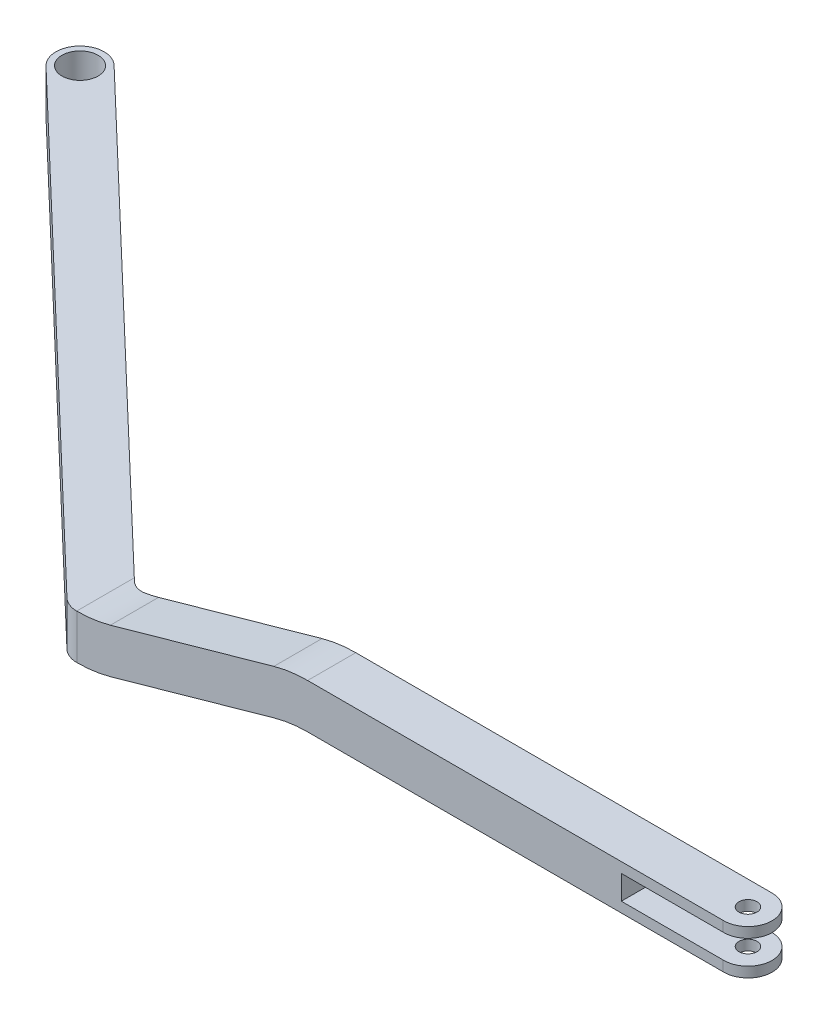
ISO-10303-21;
HEADER;
FILE_DESCRIPTION(('STEP AP214'),'2;1');
FILE_NAME('part.step','',(''),(''),'','','');
FILE_SCHEMA(('AUTOMOTIVE_DESIGN { 1 0 10303 214 1 1 1 1 }'));
ENDSEC;
DATA;
#1=APPLICATION_CONTEXT('core data for automotive mechanical design processes');
#2=APPLICATION_PROTOCOL_DEFINITION('international standard','automotive_design',2000,#1);
#3=PRODUCT_CONTEXT('',#1,'mechanical');
#4=PRODUCT('Part','Part','',(#3));
#5=PRODUCT_RELATED_PRODUCT_CATEGORY('part','',(#4));
#6=PRODUCT_DEFINITION_FORMATION('','',#4);
#7=PRODUCT_DEFINITION_CONTEXT('part definition',#1,'design');
#8=PRODUCT_DEFINITION('design','',#6,#7);
#9=PRODUCT_DEFINITION_SHAPE('','',#8);
#10=(LENGTH_UNIT() NAMED_UNIT(*) SI_UNIT(.MILLI.,.METRE.));
#11=(NAMED_UNIT(*) PLANE_ANGLE_UNIT() SI_UNIT($,.RADIAN.));
#12=(NAMED_UNIT(*) SI_UNIT($,.STERADIAN.) SOLID_ANGLE_UNIT());
#13=UNCERTAINTY_MEASURE_WITH_UNIT(LENGTH_MEASURE(1.E-05),#10,'distance_accuracy_value','');
#14=(GEOMETRIC_REPRESENTATION_CONTEXT(3) GLOBAL_UNCERTAINTY_ASSIGNED_CONTEXT((#13)) GLOBAL_UNIT_ASSIGNED_CONTEXT((#10,
#11,#12)) REPRESENTATION_CONTEXT('',''));
#15=CARTESIAN_POINT('',(0.,0.,0.));
#16=DIRECTION('',(0.,0.,1.));
#17=DIRECTION('',(1.,0.,0.));
#18=AXIS2_PLACEMENT_3D('',#15,#16,#17);
#19=CARTESIAN_POINT('',(36.9937445666572,8.3,-3.29798633083513));
#20=DIRECTION('',(0.,-1.,0.));
#21=DIRECTION('',(0.,0.,-1.));
#22=AXIS2_PLACEMENT_3D('',#19,#20,#21);
#23=CYLINDRICAL_SURFACE('',#22,2.00083185761732);
#24=DIRECTION('',(0.,-1.,0.));
#25=VECTOR('',#24,1.);
#26=CARTESIAN_POINT('',(36.9189693004379,8.3,-1.29855221538691));
#27=LINE('',#26,#25);
#28=CARTESIAN_POINT('',(36.9189693004379,8.3,-1.29855221538691));
#29=VERTEX_POINT('',#28);
#30=CARTESIAN_POINT('',(36.9189693004376,7.45,-1.29855221538692));
#31=VERTEX_POINT('',#30);
#32=EDGE_CURVE('E456',#29,#31,#27,.T.);
#33=ORIENTED_EDGE('',*,*,#32,.T.);
#34=CARTESIAN_POINT('',(36.9937445666572,7.45,-3.29798633083513));
#35=DIRECTION('',(0.,1.,0.));
#36=DIRECTION('',(0.,0.,1.));
#37=AXIS2_PLACEMENT_3D('',#34,#35,#36);
#38=CIRCLE('',#37,2.00083185761732);
#39=CARTESIAN_POINT('',(37.0301830090221,7.45,-5.2984863589217));
#40=VERTEX_POINT('',#39);
#41=EDGE_CURVE('E44',#31,#40,#38,.T.);
#42=ORIENTED_EDGE('',*,*,#41,.T.);
#43=CARTESIAN_POINT('',(36.9937445666572,7.45,-3.29798633083513));
#44=DIRECTION('',(0.,1.,0.));
#45=DIRECTION('',(0.0182116464340387,0.,-0.999834154214669));
#46=AXIS2_PLACEMENT_3D('',#43,#44,#45);
#47=CIRCLE('',#46,2.00083185761732);
#48=CARTESIAN_POINT('',(36.9573061242915,7.45,-5.29848635892169));
#49=VERTEX_POINT('',#48);
#50=EDGE_CURVE('E11',#40,#49,#47,.T.);
#51=ORIENTED_EDGE('',*,*,#50,.T.);
#52=DIRECTION('',(0.,-1.,0.));
#53=VECTOR('',#52,1.);
#54=CARTESIAN_POINT('',(36.9573061242915,8.3,-5.29848635892169));
#55=LINE('',#54,#53);
#56=CARTESIAN_POINT('',(36.9573061242915,8.3,-5.29848635892169));
#57=VERTEX_POINT('',#56);
#58=EDGE_CURVE('E410',#57,#49,#55,.T.);
#59=ORIENTED_EDGE('',*,*,#58,.F.);
#60=CARTESIAN_POINT('',(36.9937445666572,8.3,-3.29798633083513));
#61=DIRECTION('',(0.,1.,0.));
#62=DIRECTION('',(0.,0.,1.));
#63=AXIS2_PLACEMENT_3D('',#60,#61,#62);
#64=CIRCLE('',#63,2.00083185761732);
#65=EDGE_CURVE('E442',#29,#57,#64,.T.);
#66=ORIENTED_EDGE('',*,*,#65,.F.);
#67=EDGE_LOOP('',(#33,#42,#51,#59,#66));
#68=FACE_BOUND('',#67,.T.);
#69=ADVANCED_FACE('F39',(#68),#23,.T.);
#70=CARTESIAN_POINT('',(38.9945764242745,7.45,-42.6756421682449));
#71=DIRECTION('',(0.,1.,0.));
#72=DIRECTION('',(0.,0.,1.));
#73=AXIS2_PLACEMENT_3D('',#70,#71,#72);
#74=PLANE('',#73);
#75=DIRECTION('',(0.,0.,1.));
#76=VECTOR('',#75,1.);
#77=CARTESIAN_POINT('',(28.4745764242745,7.45,-42.6756421682449));
#78=LINE('',#77,#76);
#79=CARTESIAN_POINT('',(28.4745764242745,7.45,-5.29848635892169));
#80=VERTEX_POINT('',#79);
#81=CARTESIAN_POINT('',(28.4745764242745,7.45,-1.29855221538692));
#82=VERTEX_POINT('',#81);
#83=EDGE_CURVE('E406',#80,#82,#78,.T.);
#84=ORIENTED_EDGE('',*,*,#83,.F.);
#85=DIRECTION('',(-1.,0.,0.));
#86=VECTOR('',#85,1.);
#87=CARTESIAN_POINT('',(36.9573061242915,7.45,-5.29848635892169));
#88=LINE('',#87,#86);
#89=EDGE_CURVE('E382',#49,#80,#88,.T.);
#90=ORIENTED_EDGE('',*,*,#89,.F.);
#91=ORIENTED_EDGE('',*,*,#50,.F.);
#92=ORIENTED_EDGE('',*,*,#41,.F.);
#93=DIRECTION('',(-1.,0.,0.));
#94=VECTOR('',#93,1.);
#95=CARTESIAN_POINT('',(38.9945764242745,7.45,-1.29855221538692));
#96=LINE('',#95,#94);
#97=EDGE_CURVE('E549',#31,#82,#96,.T.);
#98=ORIENTED_EDGE('',*,*,#97,.T.);
#99=EDGE_LOOP('',(#84,#90,#91,#92,#98));
#100=FACE_BOUND('',#99,.T.);
#101=CARTESIAN_POINT('',(36.9937445666572,7.45,-3.29798633083513));
#102=DIRECTION('',(0.,1.,0.));
#103=DIRECTION('',(0.,0.,1.));
#104=AXIS2_PLACEMENT_3D('',#101,#102,#103);
#105=CIRCLE('',#104,0.749999999999998);
#106=CARTESIAN_POINT('',(36.9937445666572,7.45,-2.54798633083513));
#107=VERTEX_POINT('',#106);
#108=EDGE_CURVE('E370',#107,#107,#105,.T.);
#109=ORIENTED_EDGE('',*,*,#108,.T.);
#110=EDGE_LOOP('',(#109));
#111=FACE_BOUND('',#110,.T.);
#112=ADVANCED_FACE('F345',(#100,#111),#74,.F.);
#113=CARTESIAN_POINT('',(28.4745764242745,5.45,-42.6756421682449));
#114=DIRECTION('',(0.,-1.,0.));
#115=DIRECTION('',(0.,0.,-1.));
#116=AXIS2_PLACEMENT_3D('',#113,#114,#115);
#117=PLANE('',#116);
#118=DIRECTION('',(1.,0.,0.));
#119=VECTOR('',#118,1.);
#120=CARTESIAN_POINT('',(28.4745764242745,5.45,-1.29855221538692));
#121=LINE('',#120,#119);
#122=CARTESIAN_POINT('',(28.4745764242745,5.45,-1.29855221538692));
#123=VERTEX_POINT('',#122);
#124=CARTESIAN_POINT('',(36.9189693004376,5.45,-1.29855221538692));
#125=VERTEX_POINT('',#124);
#126=EDGE_CURVE('E552',#123,#125,#121,.T.);
#127=ORIENTED_EDGE('',*,*,#126,.T.);
#128=CARTESIAN_POINT('',(36.9937445666572,5.45,-3.29798633083513));
#129=DIRECTION('',(0.,-1.,0.));
#130=DIRECTION('',(0.,0.,-1.));
#131=AXIS2_PLACEMENT_3D('',#128,#129,#130);
#132=CIRCLE('',#131,2.00083185761732);
#133=CARTESIAN_POINT('',(37.0301830090221,5.45,-5.2984863589217));
#134=VERTEX_POINT('',#133);
#135=EDGE_CURVE('E63',#134,#125,#132,.T.);
#136=ORIENTED_EDGE('',*,*,#135,.F.);
#137=CARTESIAN_POINT('',(36.9937445666572,5.45,-3.29798633083513));
#138=DIRECTION('',(0.,-1.,0.));
#139=DIRECTION('',(-0.0182116464344202,0.,-0.999834154214662));
#140=AXIS2_PLACEMENT_3D('',#137,#138,#139);
#141=CIRCLE('',#140,2.00083185761732);
#142=CARTESIAN_POINT('',(36.9573061242915,5.45,-5.29848635892169));
#143=VERTEX_POINT('',#142);
#144=EDGE_CURVE('E50',#143,#134,#141,.T.);
#145=ORIENTED_EDGE('',*,*,#144,.F.);
#146=DIRECTION('',(1.,0.,0.));
#147=VECTOR('',#146,1.);
#148=CARTESIAN_POINT('',(36.9573061242915,5.45,-5.29848635892169));
#149=LINE('',#148,#147);
#150=CARTESIAN_POINT('',(28.4745764242745,5.45,-5.29848635892169));
#151=VERTEX_POINT('',#150);
#152=EDGE_CURVE('E360',#151,#143,#149,.T.);
#153=ORIENTED_EDGE('',*,*,#152,.F.);
#154=DIRECTION('',(0.,0.,1.));
#155=VECTOR('',#154,1.);
#156=CARTESIAN_POINT('',(28.4745764242745,5.45,-42.6756421682449));
#157=LINE('',#156,#155);
#158=EDGE_CURVE('E365',#151,#123,#157,.T.);
#159=ORIENTED_EDGE('',*,*,#158,.T.);
#160=EDGE_LOOP('',(#127,#136,#145,#153,#159));
#161=FACE_BOUND('',#160,.T.);
#162=CARTESIAN_POINT('',(36.9937445666572,5.45,-3.29798633083513));
#163=DIRECTION('',(0.,-1.,0.));
#164=DIRECTION('',(0.,0.,-1.));
#165=AXIS2_PLACEMENT_3D('',#162,#163,#164);
#166=CIRCLE('',#165,0.749999999999998);
#167=CARTESIAN_POINT('',(36.9937445666572,5.45,-4.04798633083512));
#168=VERTEX_POINT('',#167);
#169=EDGE_CURVE('E308',#168,#168,#166,.T.);
#170=ORIENTED_EDGE('',*,*,#169,.T.);
#171=EDGE_LOOP('',(#170));
#172=FACE_BOUND('',#171,.T.);
#173=ADVANCED_FACE('F340',(#161,#172),#117,.F.);
#174=CARTESIAN_POINT('',(36.9937445666572,8.3,-3.29798633083513));
#175=DIRECTION('',(0.,-1.,0.));
#176=DIRECTION('',(0.,0.,-1.));
#177=AXIS2_PLACEMENT_3D('',#174,#175,#176);
#178=CYLINDRICAL_SURFACE('',#177,0.749999999999998);
#179=ORIENTED_EDGE('',*,*,#108,.F.);
#180=EDGE_LOOP('',(#179));
#181=FACE_BOUND('',#180,.T.);
#182=CARTESIAN_POINT('',(36.9937445666572,8.3,-3.29798633083513));
#183=DIRECTION('',(0.,1.,0.));
#184=DIRECTION('',(0.,0.,1.));
#185=AXIS2_PLACEMENT_3D('',#182,#183,#184);
#186=CIRCLE('',#185,0.749999999999999);
#187=CARTESIAN_POINT('',(36.9937445666572,8.3,-2.54798633083513));
#188=VERTEX_POINT('',#187);
#189=EDGE_CURVE('E430',#188,#188,#186,.T.);
#190=ORIENTED_EDGE('',*,*,#189,.T.);
#191=EDGE_LOOP('',(#190));
#192=FACE_BOUND('',#191,.T.);
#193=ADVANCED_FACE('F344',(#181,#192),#178,.F.);
#194=CARTESIAN_POINT('',(36.9937445666572,8.3,-3.29798633083513));
#195=DIRECTION('',(0.,1.,0.));
#196=DIRECTION('',(0.,0.,1.));
#197=AXIS2_PLACEMENT_3D('',#194,#195,#196);
#198=PLANE('',#197);
#199=ORIENTED_EDGE('',*,*,#189,.F.);
#200=EDGE_LOOP('',(#199));
#201=FACE_BOUND('',#200,.T.);
#202=DIRECTION('',(-1.,0.,0.));
#203=VECTOR('',#202,1.);
#204=CARTESIAN_POINT('',(36.9573061242915,8.3,-5.29848635892169));
#205=LINE('',#204,#203);
#206=CARTESIAN_POINT('',(2.41497993869398,8.3,-5.2984863589217));
#207=VERTEX_POINT('',#206);
#208=EDGE_CURVE('E414',#57,#207,#205,.T.);
#209=ORIENTED_EDGE('',*,*,#208,.T.);
#210=DIRECTION('',(0.,0.,1.));
#211=VECTOR('',#210,1.);
#212=CARTESIAN_POINT('',(2.41497993869398,8.3,-42.6756421682449));
#213=LINE('',#212,#211);
#214=CARTESIAN_POINT('',(2.41497993869398,8.3,-1.29855221538692));
#215=VERTEX_POINT('',#214);
#216=EDGE_CURVE('E204',#207,#215,#213,.T.);
#217=ORIENTED_EDGE('',*,*,#216,.T.);
#218=DIRECTION('',(1.,0.,0.));
#219=VECTOR('',#218,1.);
#220=CARTESIAN_POINT('',(-16.707593816575,8.3,-1.29855221538692));
#221=LINE('',#220,#219);
#222=EDGE_CURVE('E446',#215,#29,#221,.T.);
#223=ORIENTED_EDGE('',*,*,#222,.T.);
#224=ORIENTED_EDGE('',*,*,#65,.T.);
#225=EDGE_LOOP('',(#209,#217,#223,#224));
#226=FACE_BOUND('',#225,.T.);
#227=ADVANCED_FACE('F425',(#201,#226),#198,.T.);
#228=CARTESIAN_POINT('',(36.9937445666572,0.,-3.29798633083513));
#229=DIRECTION('',(0.,1.,0.));
#230=DIRECTION('',(0.,0.,1.));
#231=AXIS2_PLACEMENT_3D('',#228,#229,#230);
#232=PLANE('',#231);
#233=CARTESIAN_POINT('',(-55.8665357872914,0.,-40.6756421682449));
#234=DIRECTION('',(0.,1.,0.));
#235=DIRECTION('',(0.,0.,1.));
#236=AXIS2_PLACEMENT_3D('',#233,#234,#235);
#237=CIRCLE('',#236,1.5);
#238=CARTESIAN_POINT('',(-55.8665357872914,0.,-39.1756421682449));
#239=VERTEX_POINT('',#238);
#240=EDGE_CURVE('E432',#239,#239,#237,.T.);
#241=ORIENTED_EDGE('',*,*,#240,.T.);
#242=EDGE_LOOP('',(#241));
#243=FACE_BOUND('',#242,.T.);
#244=DIRECTION('',(-0.723015211725438,0.,-0.690832109570495));
#245=VECTOR('',#244,1.);
#246=CARTESIAN_POINT('',(-16.5260173161096,0.,-5.85245593547083));
#247=LINE('',#246,#245);
#248=CARTESIAN_POINT('',(-16.7482829126781,0.,-6.06482796924297));
#249=VERTEX_POINT('',#248);
#250=CARTESIAN_POINT('',(-54.4848715681504,0.,-42.1216725916958));
#251=VERTEX_POINT('',#250);
#252=EDGE_CURVE('E436',#249,#251,#247,.T.);
#253=ORIENTED_EDGE('',*,*,#252,.F.);
#254=DIRECTION('',(0.,0.,1.));
#255=VECTOR('',#254,1.);
#256=CARTESIAN_POINT('',(-16.7482829126781,0.,-42.6756421682449));
#257=LINE('',#256,#255);
#258=CARTESIAN_POINT('',(-16.7482829126781,0.,-1.29855221538692));
#259=VERTEX_POINT('',#258);
#260=EDGE_CURVE('E226',#249,#259,#257,.T.);
#261=ORIENTED_EDGE('',*,*,#260,.T.);
#262=CARTESIAN_POINT('',(-16.7481986495322,0.,-3.29855392790748));
#263=DIRECTION('',(0.,1.,0.));
#264=DIRECTION('',(0.,0.,1.));
#265=AXIS2_PLACEMENT_3D('',#262,#263,#264);
#266=CIRCLE('',#265,2.00000000000003);
#267=CARTESIAN_POINT('',(-18.1298628686732,0.,-1.85252350445656));
#268=VERTEX_POINT('',#267);
#269=EDGE_CURVE('E444',#268,#259,#266,.T.);
#270=ORIENTED_EDGE('',*,*,#269,.F.);
#271=DIRECTION('',(0.723015211725438,0.,0.690832109570495));
#272=VECTOR('',#271,1.);
#273=CARTESIAN_POINT('',(-57.2482000064324,0.,-39.229611744794));
#274=LINE('',#273,#272);
#275=CARTESIAN_POINT('',(-57.2482000064324,0.,-39.229611744794));
#276=VERTEX_POINT('',#275);
#277=EDGE_CURVE('E452',#276,#268,#274,.T.);
#278=ORIENTED_EDGE('',*,*,#277,.F.);
#279=CARTESIAN_POINT('',(-55.8665357872914,0.,-40.6756421682449));
#280=DIRECTION('',(0.,1.,0.));
#281=DIRECTION('',(0.,0.,-1.));
#282=AXIS2_PLACEMENT_3D('',#279,#280,#281);
#283=CIRCLE('',#282,2.00000000000001);
#284=EDGE_CURVE('E208',#251,#276,#283,.T.);
#285=ORIENTED_EDGE('',*,*,#284,.F.);
#286=EDGE_LOOP('',(#253,#261,#270,#278,#285));
#287=FACE_BOUND('',#286,.T.);
#288=ADVANCED_FACE('F475',(#243,#287),#232,.F.);
#289=CARTESIAN_POINT('',(36.9573061242915,8.3,-5.29848635892169));
#290=DIRECTION('',(0.,0.,1.));
#291=DIRECTION('',(1.,0.,0.));
#292=AXIS2_PLACEMENT_3D('',#289,#290,#291);
#293=PLANE('',#292);
#294=ORIENTED_EDGE('',*,*,#58,.T.);
#295=ORIENTED_EDGE('',*,*,#89,.T.);
#296=DIRECTION('',(0.,-1.,0.));
#297=VECTOR('',#296,1.);
#298=CARTESIAN_POINT('',(28.4745764242745,8.3,-5.29848635892169));
#299=LINE('',#298,#297);
#300=EDGE_CURVE('E327',#80,#151,#299,.T.);
#301=ORIENTED_EDGE('',*,*,#300,.T.);
#302=ORIENTED_EDGE('',*,*,#152,.T.);
#303=CARTESIAN_POINT('',(36.9573061242915,4.60000000000001,-5.29848635892169));
#304=VERTEX_POINT('',#303);
#305=EDGE_CURVE('E221',#143,#304,#55,.T.);
#306=ORIENTED_EDGE('',*,*,#305,.T.);
#307=DIRECTION('',(-1.,0.,0.));
#308=VECTOR('',#307,1.);
#309=CARTESIAN_POINT('',(36.9573061242915,4.60000000000001,-5.29848635892169));
#310=LINE('',#309,#308);
#311=CARTESIAN_POINT('',(2.43783536205152,4.60000000000001,-5.2984863589217));
#312=VERTEX_POINT('',#311);
#313=EDGE_CURVE('E225',#304,#312,#310,.T.);
#314=ORIENTED_EDGE('',*,*,#313,.T.);
#315=CARTESIAN_POINT('',(2.43783536205152,-5.39999999999999,-5.29848635892169));
#316=DIRECTION('',(0.,0.,1.));
#317=DIRECTION('',(1.,0.,0.));
#318=AXIS2_PLACEMENT_3D('',#315,#316,#317);
#319=ELLIPSE('',#318,10.1767339402036,10.);
#320=CARTESIAN_POINT('',(-0.367252672079279,4.21261695938321,-5.29848635892169));
#321=VERTEX_POINT('',#320);
#322=EDGE_CURVE('E289',#312,#321,#319,.T.);
#323=ORIENTED_EDGE('',*,*,#322,.T.);
#324=DIRECTION('',(-0.962521476409949,-0.271205470906492,0.));
#325=VECTOR('',#324,1.);
#326=CARTESIAN_POINT('',(35.2789698930869,14.2564973441426,-5.29848635892169));
#327=LINE('',#326,#325);
#328=CARTESIAN_POINT('',(-13.9431948785473,0.387383040616798,-5.2984863589217));
#329=VERTEX_POINT('',#328);
#330=EDGE_CURVE('E518',#321,#329,#327,.T.);
#331=ORIENTED_EDGE('',*,*,#330,.T.);
#332=CARTESIAN_POINT('',(-16.7482829126781,10.,-5.29848635892169));
#333=DIRECTION('',(0.,0.,1.));
#334=DIRECTION('',(-1.,0.,0.));
#335=AXIS2_PLACEMENT_3D('',#332,#333,#334);
#336=ELLIPSE('',#335,10.1767339402036,10.);
#337=CARTESIAN_POINT('',(-15.1443530969686,0.124981675503623,-5.29848635892171));
#338=VERTEX_POINT('',#337);
#339=EDGE_CURVE('E433',#338,#329,#336,.T.);
#340=ORIENTED_EDGE('',*,*,#339,.F.);
#341=DIRECTION('',(0.,-1.,0.));
#342=VECTOR('',#341,1.);
#343=CARTESIAN_POINT('',(-15.1443530969686,8.3,-5.2984863589217));
#344=LINE('',#343,#342);
#345=CARTESIAN_POINT('',(-15.1443530969686,3.82859230214382,-5.29848635892171));
#346=VERTEX_POINT('',#345);
#347=EDGE_CURVE('E219',#346,#338,#344,.T.);
#348=ORIENTED_EDGE('',*,*,#347,.F.);
#349=CARTESIAN_POINT('',(-16.7711383360356,13.7,-5.29848635892169));
#350=DIRECTION('',(0.,0.,1.));
#351=DIRECTION('',(1.,0.,0.));
#352=AXIS2_PLACEMENT_3D('',#349,#350,#351);
#353=ELLIPSE('',#352,10.1767339402036,10.);
#354=CARTESIAN_POINT('',(-13.9660503019048,4.0873830406168,-5.29848635892169));
#355=VERTEX_POINT('',#354);
#356=EDGE_CURVE('E572',#346,#355,#353,.T.);
#357=ORIENTED_EDGE('',*,*,#356,.T.);
#358=DIRECTION('',(0.962521476409949,0.271205470906491,0.));
#359=VECTOR('',#358,1.);
#360=CARTESIAN_POINT('',(34.3114367876864,17.6903196412108,-5.29848635892169));
#361=LINE('',#360,#359);
#362=CARTESIAN_POINT('',(-0.390108095436824,7.9126169593832,-5.2984863589217));
#363=VERTEX_POINT('',#362);
#364=EDGE_CURVE('E269',#355,#363,#361,.T.);
#365=ORIENTED_EDGE('',*,*,#364,.T.);
#366=CARTESIAN_POINT('',(2.41497993869397,-1.7,-5.29848635892169));
#367=DIRECTION('',(0.,0.,-1.));
#368=DIRECTION('',(-1.,0.,0.));
#369=AXIS2_PLACEMENT_3D('',#366,#367,#368);
#370=ELLIPSE('',#369,10.1767339402036,10.);
#371=EDGE_CURVE('E568',#363,#207,#370,.T.);
#372=ORIENTED_EDGE('',*,*,#371,.T.);
#373=ORIENTED_EDGE('',*,*,#208,.F.);
#374=EDGE_LOOP('',(#294,#295,#301,#302,#306,#314,#323,#331,#340,#348,#357,#365,#372,#373));
#375=FACE_BOUND('',#374,.T.);
#376=ADVANCED_FACE('F411',(#375),#293,.F.);
#377=CARTESIAN_POINT('',(-15.1443530969686,8.3,-7.2984863589217));
#378=DIRECTION('',(0.,-1.,0.));
#379=DIRECTION('',(0.,0.,-1.));
#380=AXIS2_PLACEMENT_3D('',#377,#378,#379);
#381=CYLINDRICAL_SURFACE('',#380,1.99999999999999);
#382=DIRECTION('',(0.,-1.,0.));
#383=VECTOR('',#382,1.);
#384=CARTESIAN_POINT('',(-16.5260173161096,8.3,-5.85245593547083));
#385=LINE('',#384,#383);
#386=CARTESIAN_POINT('',(-16.5260173161096,3.70290119738029,-5.85245593547083));
#387=VERTEX_POINT('',#386);
#388=CARTESIAN_POINT('',(-16.5260173161096,0.00238533540510271,-5.85245593547083));
#389=VERTEX_POINT('',#388);
#390=EDGE_CURVE('E212',#387,#389,#385,.T.);
#391=ORIENTED_EDGE('',*,*,#390,.F.);
#392=CARTESIAN_POINT('',(-16.5260173161096,3.70290119738029,-5.85245593547083));
#393=CARTESIAN_POINT('',(-16.4858217405346,3.70385154125688,-5.81404147290284));
#394=CARTESIAN_POINT('',(-16.4440208871399,3.70507660719029,-5.77731599438412));
#395=CARTESIAN_POINT('',(-16.3575227528893,3.70817261746892,-5.70747935555764));
#396=CARTESIAN_POINT('',(-16.3128254131862,3.7100435749399,-5.67436826871923));
#397=CARTESIAN_POINT('',(-16.220825476771,3.71452897199333,-5.61198165077404));
#398=CARTESIAN_POINT('',(-16.1735214982762,3.71714380902462,-5.58270818232273));
#399=CARTESIAN_POINT('',(-16.0766973392706,3.72319520432481,-5.52822550124349));
#400=CARTESIAN_POINT('',(-16.0271773005915,3.72663171006638,-5.50301602898634));
#401=CARTESIAN_POINT('',(-15.8757427206918,3.73828670623872,-5.43371431806882));
#402=CARTESIAN_POINT('',(-15.7709523291798,3.74785073776684,-5.3959478479173));
#403=CARTESIAN_POINT('',(-15.5571663432736,3.77084387299733,-5.33843224894582));
#404=CARTESIAN_POINT('',(-15.4481798642928,3.78426496732322,-5.31864613382681));
#405=CARTESIAN_POINT('',(-15.3063468948048,3.80407619196059,-5.30479097496266));
#406=CARTESIAN_POINT('',(-15.2739379549737,3.80876062742215,-5.30242411304849));
#407=CARTESIAN_POINT('',(-15.2091328174261,3.81844257222107,-5.29927359297725));
#408=CARTESIAN_POINT('',(-15.1767366575702,3.82343966822127,-5.2984878882954));
#409=CARTESIAN_POINT('',(-15.1443530969686,3.82859230214383,-5.29848635892171));
#410=B_SPLINE_CURVE_WITH_KNOTS('',3,(#392,#393,#394,#395,#396,#397,#398,#399,#400,#401,#402,
#403,#404,#405,#406,#407,#408,#409),.UNSPECIFIED.,.F.,.F.,(4,2,2,2,2,2,2,2,4),(0.,
0.166772091527426,0.33354757238191,0.500412327920719,0.667266419042723,1.00096964178975,
1.33398485969385,1.43245119316598,1.53078999742635),.UNSPECIFIED.);
#411=EDGE_CURVE('E497',#387,#346,#410,.T.);
#412=ORIENTED_EDGE('',*,*,#411,.T.);
#413=ORIENTED_EDGE('',*,*,#347,.T.);
#414=CARTESIAN_POINT('',(-16.5260173161096,0.00238533540510271,-5.85245593547083));
#415=CARTESIAN_POINT('',(-16.4858231527149,0.00324687503576391,-5.81404284685564));
#416=CARTESIAN_POINT('',(-16.4440234799147,0.00437954000276688,-5.77731824630781));
#417=CARTESIAN_POINT('',(-16.3575267281272,0.00728423001760441,-5.70748240679937));
#418=CARTESIAN_POINT('',(-16.3128295864509,0.00905626890259747,-5.67437124606006));
#419=CARTESIAN_POINT('',(-16.2208277732829,0.013337974182148,-5.61198306060994));
#420=CARTESIAN_POINT('',(-16.1735216694978,0.0158480490926583,-5.58270817235212));
#421=CARTESIAN_POINT('',(-16.0766913802723,0.0216849128461143,-5.52822225457412));
#422=CARTESIAN_POINT('',(-16.027167337458,0.0250116492344696,-5.50301096421916));
#423=CARTESIAN_POINT('',(-15.8757166336213,0.0363308873924351,-5.43370338792472));
#424=CARTESIAN_POINT('',(-15.7709106499402,0.0456624499978899,-5.39593289151855));
#425=CARTESIAN_POINT('',(-15.5570838160455,0.0681810909279192,-5.33841378377238));
#426=CARTESIAN_POINT('',(-15.4480721427259,0.0813601458060907,-5.31862801730156));
#427=CARTESIAN_POINT('',(-15.3062334061807,0.100851709516164,-5.30478214566609));
#428=CARTESIAN_POINT('',(-15.2738477382854,0.105459345172356,-5.30241863224336));
#429=CARTESIAN_POINT('',(-15.2090883178915,0.114987073488589,-5.29927252230627));
#430=CARTESIAN_POINT('',(-15.1767146040034,0.119906755012077,-5.29848788840278));
#431=CARTESIAN_POINT('',(-15.1443530969686,0.124981675503628,-5.29848635892171));
#432=B_SPLINE_CURVE_WITH_KNOTS('',3,(#414,#415,#416,#417,#418,#419,#420,#421,#422,#423,#424,
#425,#426,#427,#428,#429,#430,#431),.UNSPECIFIED.,.F.,.F.,(4,2,2,2,2,2,2,2,4),(0.,
0.166761886950087,0.333527383132606,0.50038536128926,0.667232624874279,1.00092447909018,
1.33392537316692,1.43228949474585,1.53052660546878),.UNSPECIFIED.);
#433=EDGE_CURVE('E438',#389,#338,#432,.T.);
#434=ORIENTED_EDGE('',*,*,#433,.F.);
#435=EDGE_LOOP('',(#391,#412,#413,#434));
#436=FACE_BOUND('',#435,.T.);
#437=ADVANCED_FACE('F508',(#436),#381,.F.);
#438=CARTESIAN_POINT('',(-16.5260173161096,8.3,-5.85245593547083));
#439=DIRECTION('',(-0.690832109570495,0.,0.723015211725438));
#440=DIRECTION('',(0.723015211725438,0.,0.690832109570495));
#441=AXIS2_PLACEMENT_3D('',#438,#439,#440);
#442=PLANE('',#441);
#443=DIRECTION('',(0.,-1.,0.));
#444=VECTOR('',#443,1.);
#445=CARTESIAN_POINT('',(-54.4848715681504,8.3,-42.1216725916958));
#446=LINE('',#445,#444);
#447=CARTESIAN_POINT('',(-54.4848715681504,3.7,-42.1216725916958));
#448=VERTEX_POINT('',#447);
#449=EDGE_CURVE('E210',#448,#251,#446,.T.);
#450=ORIENTED_EDGE('',*,*,#449,.F.);
#451=DIRECTION('',(0.723015211725438,0.,0.690832109570495));
#452=VECTOR('',#451,1.);
#453=CARTESIAN_POINT('',(-16.5260173161096,3.7,-5.85245593547083));
#454=LINE('',#453,#452);
#455=CARTESIAN_POINT('',(-16.7711383360356,3.7,-6.0866660441232));
#456=VERTEX_POINT('',#455);
#457=EDGE_CURVE('E190',#448,#456,#454,.T.);
#458=ORIENTED_EDGE('',*,*,#457,.T.);
#459=CARTESIAN_POINT('',(-16.7711383360356,3.7,-6.08666604412319));
#460=CARTESIAN_POINT('',(-16.7302818409111,3.69999998279812,-6.04762816738314));
#461=CARTESIAN_POINT('',(-16.6894268416883,3.70024174064554,-6.00859171995876));
#462=CARTESIAN_POINT('',(-16.6077198350463,3.70120880643897,-5.93052168374131));
#463=CARTESIAN_POINT('',(-16.5668678276271,3.70193411438498,-5.89148809494824));
#464=CARTESIAN_POINT('',(-16.5260173161096,3.70290119738029,-5.85245593547083));
#465=B_SPLINE_CURVE_WITH_KNOTS('',3,(#459,#460,#461,#462,#463,#464),.UNSPECIFIED.,.F.,.F.,(4,2,
4),(0.,0.169520803215356,0.339041606430711),.UNSPECIFIED.);
#466=EDGE_CURVE('E480',#456,#387,#465,.T.);
#467=ORIENTED_EDGE('',*,*,#466,.T.);
#468=ORIENTED_EDGE('',*,*,#390,.T.);
#469=CARTESIAN_POINT('',(-16.7482829126781,0.,-6.06482796924297));
#470=CARTESIAN_POINT('',(-16.7112364161821,-1.162841886894E-08,-6.02943049916016));
#471=CARTESIAN_POINT('',(-16.6741910348868,0.000198760507796998,-5.99403409463774));
#472=CARTESIAN_POINT('',(-16.6001025026973,0.000993872309498199,-5.92324341671369));
#473=CARTESIAN_POINT('',(-16.5630593518032,0.00159021197498352,-5.88784914331207));
#474=CARTESIAN_POINT('',(-16.5260173161096,0.00238533540510358,-5.85245593547083));
#475=B_SPLINE_CURVE_WITH_KNOTS('',3,(#469,#470,#471,#472,#473,#474),.UNSPECIFIED.,.F.,.F.,(4,2,
4),(0.,0.153713197706431,0.307426395412859),.UNSPECIFIED.);
#476=EDGE_CURVE('E513',#249,#389,#475,.T.);
#477=ORIENTED_EDGE('',*,*,#476,.F.);
#478=ORIENTED_EDGE('',*,*,#252,.T.);
#479=EDGE_LOOP('',(#450,#458,#467,#468,#477,#478));
#480=FACE_BOUND('',#479,.T.);
#481=ADVANCED_FACE('F504',(#480),#442,.F.);
#482=CARTESIAN_POINT('',(-16.707593816575,8.3,-1.29855221538692));
#483=DIRECTION('',(0.,0.,-1.));
#484=DIRECTION('',(-1.,0.,0.));
#485=AXIS2_PLACEMENT_3D('',#482,#483,#484);
#486=PLANE('',#485);
#487=DIRECTION('',(0.,-1.,0.));
#488=VECTOR('',#487,1.);
#489=CARTESIAN_POINT('',(28.4745764242745,7.45,-1.29855221538692));
#490=LINE('',#489,#488);
#491=EDGE_CURVE('E194',#82,#123,#490,.T.);
#492=ORIENTED_EDGE('',*,*,#491,.F.);
#493=ORIENTED_EDGE('',*,*,#97,.F.);
#494=ORIENTED_EDGE('',*,*,#32,.F.);
#495=ORIENTED_EDGE('',*,*,#222,.F.);
#496=CARTESIAN_POINT('',(2.41497993869397,-1.7,-1.29855221538692));
#497=DIRECTION('',(0.,0.,-1.));
#498=DIRECTION('',(-1.,0.,0.));
#499=AXIS2_PLACEMENT_3D('',#496,#497,#498);
#500=ELLIPSE('',#499,10.1767339402036,10.);
#501=CARTESIAN_POINT('',(-0.390108095436824,7.9126169593832,-1.29855221538692));
#502=VERTEX_POINT('',#501);
#503=EDGE_CURVE('E482',#502,#215,#500,.T.);
#504=ORIENTED_EDGE('',*,*,#503,.F.);
#505=DIRECTION('',(0.962521476409949,0.271205470906491,0.));
#506=VECTOR('',#505,1.);
#507=CARTESIAN_POINT('',(-13.9660503019048,4.0873830406168,-1.29855221538692));
#508=LINE('',#507,#506);
#509=CARTESIAN_POINT('',(-13.9660503019048,4.0873830406168,-1.29855221538692));
#510=VERTEX_POINT('',#509);
#511=EDGE_CURVE('E486',#510,#502,#508,.T.);
#512=ORIENTED_EDGE('',*,*,#511,.F.);
#513=CARTESIAN_POINT('',(-16.7711383360356,13.7,-1.29855221538692));
#514=DIRECTION('',(0.,0.,1.));
#515=DIRECTION('',(1.,0.,0.));
#516=AXIS2_PLACEMENT_3D('',#513,#514,#515);
#517=ELLIPSE('',#516,10.1767339402036,10.);
#518=CARTESIAN_POINT('',(-16.7482829126781,3.70002521925491,-1.29855392968252));
#519=VERTEX_POINT('',#518);
#520=EDGE_CURVE('E331',#519,#510,#517,.T.);
#521=ORIENTED_EDGE('',*,*,#520,.F.);
#522=DIRECTION('',(0.,-1.,0.));
#523=VECTOR('',#522,1.);
#524=CARTESIAN_POINT('',(-16.7482829126781,8.3,-1.29855392968252));
#525=LINE('',#524,#523);
#526=EDGE_CURVE('E214',#519,#259,#525,.T.);
#527=ORIENTED_EDGE('',*,*,#526,.T.);
#528=CARTESIAN_POINT('',(-16.7482829126781,10.,-1.29855221538692));
#529=DIRECTION('',(0.,0.,1.));
#530=DIRECTION('',(-1.,0.,0.));
#531=AXIS2_PLACEMENT_3D('',#528,#529,#530);
#532=ELLIPSE('',#531,10.1767339402036,10.);
#533=CARTESIAN_POINT('',(-13.9431948785473,0.387383040616798,-1.29855221538692));
#534=VERTEX_POINT('',#533);
#535=EDGE_CURVE('E265',#259,#534,#532,.T.);
#536=ORIENTED_EDGE('',*,*,#535,.T.);
#537=DIRECTION('',(-0.962521476409949,-0.271205470906492,0.));
#538=VECTOR('',#537,1.);
#539=CARTESIAN_POINT('',(-0.367252672079279,4.21261695938321,-1.29855221538692));
#540=LINE('',#539,#538);
#541=CARTESIAN_POINT('',(-0.367252672079279,4.21261695938321,-1.29855221538692));
#542=VERTEX_POINT('',#541);
#543=EDGE_CURVE('E268',#542,#534,#540,.T.);
#544=ORIENTED_EDGE('',*,*,#543,.F.);
#545=CARTESIAN_POINT('',(2.43783536205152,-5.39999999999999,-1.29855221538692));
#546=DIRECTION('',(0.,0.,1.));
#547=DIRECTION('',(1.,0.,0.));
#548=AXIS2_PLACEMENT_3D('',#545,#546,#547);
#549=ELLIPSE('',#548,10.1767339402036,10.);
#550=CARTESIAN_POINT('',(2.43783536205152,4.60000000000001,-1.29855221538692));
#551=VERTEX_POINT('',#550);
#552=EDGE_CURVE('E272',#551,#542,#549,.T.);
#553=ORIENTED_EDGE('',*,*,#552,.F.);
#554=DIRECTION('',(-1.,0.,0.));
#555=VECTOR('',#554,1.);
#556=CARTESIAN_POINT('',(36.9189693004379,4.60000000000001,-1.29855221538692));
#557=LINE('',#556,#555);
#558=CARTESIAN_POINT('',(36.9189693004379,4.60000000000001,-1.29855221538691));
#559=VERTEX_POINT('',#558);
#560=EDGE_CURVE('E275',#559,#551,#557,.T.);
#561=ORIENTED_EDGE('',*,*,#560,.F.);
#562=EDGE_CURVE('E448',#125,#559,#27,.T.);
#563=ORIENTED_EDGE('',*,*,#562,.F.);
#564=ORIENTED_EDGE('',*,*,#126,.F.);
#565=EDGE_LOOP('',(#492,#493,#494,#495,#504,#512,#521,#527,#536,#544,#553,#561,#563,#564));
#566=FACE_BOUND('',#565,.T.);
#567=ADVANCED_FACE('F462',(#566),#486,.F.);
#568=ORIENTED_EDGE('',*,*,#135,.T.);
#569=ORIENTED_EDGE('',*,*,#562,.T.);
#570=CARTESIAN_POINT('',(36.9937445666572,4.60000000000001,-3.29798633083513));
#571=DIRECTION('',(0.,1.,0.));
#572=DIRECTION('',(0.,0.,1.));
#573=AXIS2_PLACEMENT_3D('',#570,#571,#572);
#574=CIRCLE('',#573,2.00083185761732);
#575=CARTESIAN_POINT('',(37.0301830090221,4.60000000000001,-5.2984863589217));
#576=VERTEX_POINT('',#575);
#577=EDGE_CURVE('E292',#559,#576,#574,.T.);
#578=ORIENTED_EDGE('',*,*,#577,.T.);
#579=CARTESIAN_POINT('',(36.9937445666572,4.60000000000001,-3.29798633083513));
#580=DIRECTION('',(0.,1.,0.));
#581=DIRECTION('',(0.0182116464340387,0.,-0.999834154214669));
#582=AXIS2_PLACEMENT_3D('',#579,#580,#581);
#583=CIRCLE('',#582,2.00083185761732);
#584=EDGE_CURVE('E233',#576,#304,#583,.T.);
#585=ORIENTED_EDGE('',*,*,#584,.T.);
#586=ORIENTED_EDGE('',*,*,#305,.F.);
#587=ORIENTED_EDGE('',*,*,#144,.T.);
#588=EDGE_LOOP('',(#568,#569,#578,#585,#586,#587));
#589=FACE_BOUND('',#588,.T.);
#590=ADVANCED_FACE('F41',(#589),#23,.T.);
#591=CARTESIAN_POINT('',(-55.8665357872914,8.3,-40.6756421682449));
#592=DIRECTION('',(0.,-1.,0.));
#593=DIRECTION('',(0.,0.,-1.));
#594=AXIS2_PLACEMENT_3D('',#591,#592,#593);
#595=CYLINDRICAL_SURFACE('',#594,2.00000000000001);
#596=DIRECTION('',(0.,-1.,0.));
#597=VECTOR('',#596,1.);
#598=CARTESIAN_POINT('',(-57.2482000064324,8.3,-39.229611744794));
#599=LINE('',#598,#597);
#600=CARTESIAN_POINT('',(-57.2482000064324,3.7,-39.229611744794));
#601=VERTEX_POINT('',#600);
#602=EDGE_CURVE('E201',#601,#276,#599,.T.);
#603=ORIENTED_EDGE('',*,*,#602,.F.);
#604=CARTESIAN_POINT('',(-55.8665357872914,3.7,-40.6756421682449));
#605=DIRECTION('',(0.,-1.,0.));
#606=DIRECTION('',(0.,0.,-1.));
#607=AXIS2_PLACEMENT_3D('',#604,#605,#606);
#608=CIRCLE('',#607,2.00000000000001);
#609=EDGE_CURVE('E183',#601,#448,#608,.T.);
#610=ORIENTED_EDGE('',*,*,#609,.T.);
#611=ORIENTED_EDGE('',*,*,#449,.T.);
#612=ORIENTED_EDGE('',*,*,#284,.T.);
#613=EDGE_LOOP('',(#603,#610,#611,#612));
#614=FACE_BOUND('',#613,.T.);
#615=ADVANCED_FACE('F206',(#614),#595,.T.);
#616=CARTESIAN_POINT('',(-57.2482000064324,8.3,-39.229611744794));
#617=DIRECTION('',(0.690832109570495,0.,-0.723015211725438));
#618=DIRECTION('',(-0.723015211725438,0.,-0.690832109570495));
#619=AXIS2_PLACEMENT_3D('',#616,#617,#618);
#620=PLANE('',#619);
#621=DIRECTION('',(-0.723015211725438,0.,-0.690832109570495));
#622=VECTOR('',#621,1.);
#623=CARTESIAN_POINT('',(-57.2482000064324,3.7,-39.229611744794));
#624=LINE('',#623,#622);
#625=CARTESIAN_POINT('',(-18.1298628686732,3.7,-1.85252350445656));
#626=VERTEX_POINT('',#625);
#627=EDGE_CURVE('E188',#626,#601,#624,.T.);
#628=ORIENTED_EDGE('',*,*,#627,.T.);
#629=ORIENTED_EDGE('',*,*,#602,.T.);
#630=ORIENTED_EDGE('',*,*,#277,.T.);
#631=DIRECTION('',(0.,-1.,0.));
#632=VECTOR('',#631,1.);
#633=CARTESIAN_POINT('',(-18.1298628686732,8.3,-1.85252350445656));
#634=LINE('',#633,#632);
#635=EDGE_CURVE('E203',#626,#268,#634,.T.);
#636=ORIENTED_EDGE('',*,*,#635,.F.);
#637=EDGE_LOOP('',(#628,#629,#630,#636));
#638=FACE_BOUND('',#637,.T.);
#639=ADVANCED_FACE('F199',(#638),#620,.F.);
#640=CARTESIAN_POINT('',(-16.7481986495322,8.3,-3.29855392790748));
#641=DIRECTION('',(0.,-1.,0.));
#642=DIRECTION('',(0.,0.,-1.));
#643=AXIS2_PLACEMENT_3D('',#640,#641,#642);
#644=CYLINDRICAL_SURFACE('',#643,2.00000000000003);
#645=ORIENTED_EDGE('',*,*,#526,.F.);
#646=CARTESIAN_POINT('',(-16.748282912678,3.70002521925491,-1.29855392968252));
#647=CARTESIAN_POINT('',(-16.7520922705551,3.7000168126995,-1.29855409032792));
#648=CARTESIAN_POINT('',(-16.7559015681068,3.70001050781722,-1.29856513397198));
#649=CARTESIAN_POINT('',(-16.7635200425593,3.70000210139892,-1.2986089872574));
#650=CARTESIAN_POINT('',(-16.7673292194602,3.69999999986289,-1.29864179689877));
#651=CARTESIAN_POINT('',(-16.7711383360356,3.7,-1.29868548953879));
#652=B_SPLINE_CURVE_WITH_KNOTS('',3,(#646,#647,#648,#649,#650,#651),.UNSPECIFIED.,.F.,.F.,(4,2,
4),(0.,0.0114279563333715,0.0228559126667471),.UNSPECIFIED.);
#653=CARTESIAN_POINT('',(-16.7711383360356,3.7,-1.29868548953878));
#654=VERTEX_POINT('',#653);
#655=EDGE_CURVE('E300',#519,#654,#652,.T.);
#656=ORIENTED_EDGE('',*,*,#655,.T.);
#657=CARTESIAN_POINT('',(-16.7481986495322,3.7,-3.29855392790748));
#658=DIRECTION('',(0.,-1.,0.));
#659=DIRECTION('',(0.,0.,-1.));
#660=AXIS2_PLACEMENT_3D('',#657,#658,#659);
#661=CIRCLE('',#660,2.00000000000003);
#662=EDGE_CURVE('E298',#654,#626,#661,.T.);
#663=ORIENTED_EDGE('',*,*,#662,.T.);
#664=ORIENTED_EDGE('',*,*,#635,.T.);
#665=ORIENTED_EDGE('',*,*,#269,.T.);
#666=EDGE_LOOP('',(#645,#656,#663,#664,#665));
#667=FACE_BOUND('',#666,.T.);
#668=ADVANCED_FACE('F310',(#667),#644,.T.);
#669=CARTESIAN_POINT('',(-55.8665357872914,8.3,-40.6756421682449));
#670=DIRECTION('',(0.,-1.,0.));
#671=DIRECTION('',(0.,0.,-1.));
#672=AXIS2_PLACEMENT_3D('',#669,#670,#671);
#673=CYLINDRICAL_SURFACE('',#672,1.5);
#674=CARTESIAN_POINT('',(-55.8665357872914,3.7,-40.6756421682449));
#675=DIRECTION('',(0.,-1.,0.));
#676=DIRECTION('',(0.,0.,-1.));
#677=AXIS2_PLACEMENT_3D('',#674,#675,#676);
#678=CIRCLE('',#677,1.5);
#679=CARTESIAN_POINT('',(-55.8665357872914,3.7,-42.1756421682449));
#680=VERTEX_POINT('',#679);
#681=EDGE_CURVE('E195',#680,#680,#678,.T.);
#682=ORIENTED_EDGE('',*,*,#681,.F.);
#683=EDGE_LOOP('',(#682));
#684=FACE_BOUND('',#683,.T.);
#685=ORIENTED_EDGE('',*,*,#240,.F.);
#686=EDGE_LOOP('',(#685));
#687=FACE_BOUND('',#686,.T.);
#688=ADVANCED_FACE('F528',(#684,#687),#673,.F.);
#689=ORIENTED_EDGE('',*,*,#169,.F.);
#690=EDGE_LOOP('',(#689));
#691=FACE_BOUND('',#690,.T.);
#692=CARTESIAN_POINT('',(36.9937445666572,4.60000000000001,-3.29798633083513));
#693=DIRECTION('',(0.,1.,0.));
#694=DIRECTION('',(0.,0.,1.));
#695=AXIS2_PLACEMENT_3D('',#692,#693,#694);
#696=CIRCLE('',#695,0.749999999999998);
#697=CARTESIAN_POINT('',(36.9937445666572,4.60000000000001,-2.54798633083513));
#698=VERTEX_POINT('',#697);
#699=EDGE_CURVE('E222',#698,#698,#696,.T.);
#700=ORIENTED_EDGE('',*,*,#699,.F.);
#701=EDGE_LOOP('',(#700));
#702=FACE_BOUND('',#701,.T.);
#703=ADVANCED_FACE('F427',(#691,#702),#178,.F.);
#704=CARTESIAN_POINT('',(-16.7482829126781,10.,-42.6756421682449));
#705=DIRECTION('',(0.,0.,1.));
#706=DIRECTION('',(-1.,0.,0.));
#707=AXIS2_PLACEMENT_3D('',#704,#705,#706);
#708=ELLIPSE('',#707,10.1767339402036,10.);
#709=DIRECTION('',(0.,0.,1.));
#710=VECTOR('',#709,1.);
#711=SURFACE_OF_LINEAR_EXTRUSION('',#708,#710);
#712=ORIENTED_EDGE('',*,*,#339,.T.);
#713=DIRECTION('',(0.,0.,1.));
#714=VECTOR('',#713,1.);
#715=CARTESIAN_POINT('',(-13.9431948785473,0.387383040616798,-42.6756421682449));
#716=LINE('',#715,#714);
#717=EDGE_CURVE('E282',#329,#534,#716,.T.);
#718=ORIENTED_EDGE('',*,*,#717,.T.);
#719=ORIENTED_EDGE('',*,*,#535,.F.);
#720=ORIENTED_EDGE('',*,*,#260,.F.);
#721=ORIENTED_EDGE('',*,*,#476,.T.);
#722=ORIENTED_EDGE('',*,*,#433,.T.);
#723=EDGE_LOOP('',(#712,#718,#719,#720,#721,#722));
#724=FACE_BOUND('',#723,.T.);
#725=ADVANCED_FACE('F468',(#724),#711,.T.);
#726=CARTESIAN_POINT('',(-0.367252672079279,4.21261695938321,-42.6756421682449));
#727=DIRECTION('',(-0.271205470906492,0.962521476409949,0.));
#728=DIRECTION('',(-0.962521476409949,-0.271205470906492,0.));
#729=AXIS2_PLACEMENT_3D('',#726,#727,#728);
#730=PLANE('',#729);
#731=DIRECTION('',(0.,0.,1.));
#732=VECTOR('',#731,1.);
#733=CARTESIAN_POINT('',(-0.367252672079279,4.21261695938321,-42.6756421682449));
#734=LINE('',#733,#732);
#735=EDGE_CURVE('E280',#321,#542,#734,.T.);
#736=ORIENTED_EDGE('',*,*,#735,.T.);
#737=ORIENTED_EDGE('',*,*,#543,.T.);
#738=ORIENTED_EDGE('',*,*,#717,.F.);
#739=ORIENTED_EDGE('',*,*,#330,.F.);
#740=EDGE_LOOP('',(#736,#737,#738,#739));
#741=FACE_BOUND('',#740,.T.);
#742=ADVANCED_FACE('F257',(#741),#730,.F.);
#743=CARTESIAN_POINT('',(2.43783536205152,-5.39999999999999,-42.6756421682449));
#744=DIRECTION('',(0.,0.,1.));
#745=DIRECTION('',(1.,0.,0.));
#746=AXIS2_PLACEMENT_3D('',#743,#744,#745);
#747=ELLIPSE('',#746,10.1767339402036,10.);
#748=DIRECTION('',(0.,0.,1.));
#749=VECTOR('',#748,1.);
#750=SURFACE_OF_LINEAR_EXTRUSION('',#747,#749);
#751=DIRECTION('',(0.,0.,1.));
#752=VECTOR('',#751,1.);
#753=CARTESIAN_POINT('',(2.43783536205152,4.60000000000001,-42.6756421682449));
#754=LINE('',#753,#752);
#755=EDGE_CURVE('E277',#312,#551,#754,.T.);
#756=ORIENTED_EDGE('',*,*,#755,.T.);
#757=ORIENTED_EDGE('',*,*,#552,.T.);
#758=ORIENTED_EDGE('',*,*,#735,.F.);
#759=ORIENTED_EDGE('',*,*,#322,.F.);
#760=EDGE_LOOP('',(#756,#757,#758,#759));
#761=FACE_BOUND('',#760,.T.);
#762=ADVANCED_FACE('F251',(#761),#750,.F.);
#763=CARTESIAN_POINT('',(36.9189693004379,4.60000000000001,-42.6756421682449));
#764=DIRECTION('',(0.,1.,0.));
#765=DIRECTION('',(0.,0.,1.));
#766=AXIS2_PLACEMENT_3D('',#763,#764,#765);
#767=PLANE('',#766);
#768=ORIENTED_EDGE('',*,*,#699,.T.);
#769=EDGE_LOOP('',(#768));
#770=FACE_BOUND('',#769,.T.);
#771=ORIENTED_EDGE('',*,*,#584,.F.);
#772=ORIENTED_EDGE('',*,*,#577,.F.);
#773=ORIENTED_EDGE('',*,*,#560,.T.);
#774=ORIENTED_EDGE('',*,*,#755,.F.);
#775=ORIENTED_EDGE('',*,*,#313,.F.);
#776=EDGE_LOOP('',(#771,#772,#773,#774,#775));
#777=FACE_BOUND('',#776,.T.);
#778=ADVANCED_FACE('F240',(#770,#777),#767,.F.);
#779=CARTESIAN_POINT('',(-13.9660503019048,4.0873830406168,-42.6756421682449));
#780=DIRECTION('',(0.271205470906491,-0.962521476409949,0.));
#781=DIRECTION('',(0.962521476409949,0.271205470906491,0.));
#782=AXIS2_PLACEMENT_3D('',#779,#780,#781);
#783=PLANE('',#782);
#784=DIRECTION('',(0.,0.,1.));
#785=VECTOR('',#784,1.);
#786=CARTESIAN_POINT('',(-13.9660503019048,4.0873830406168,-42.6756421682449));
#787=LINE('',#786,#785);
#788=EDGE_CURVE('E481',#355,#510,#787,.T.);
#789=ORIENTED_EDGE('',*,*,#788,.T.);
#790=ORIENTED_EDGE('',*,*,#511,.T.);
#791=DIRECTION('',(0.,0.,1.));
#792=VECTOR('',#791,1.);
#793=CARTESIAN_POINT('',(-0.390108095436824,7.9126169593832,-42.6756421682449));
#794=LINE('',#793,#792);
#795=EDGE_CURVE('E484',#363,#502,#794,.T.);
#796=ORIENTED_EDGE('',*,*,#795,.F.);
#797=ORIENTED_EDGE('',*,*,#364,.F.);
#798=EDGE_LOOP('',(#789,#790,#796,#797));
#799=FACE_BOUND('',#798,.T.);
#800=ADVANCED_FACE('F250',(#799),#783,.F.);
#801=CARTESIAN_POINT('',(2.41497993869397,-1.7,-42.6756421682449));
#802=DIRECTION('',(0.,0.,-1.));
#803=DIRECTION('',(-1.,0.,0.));
#804=AXIS2_PLACEMENT_3D('',#801,#802,#803);
#805=ELLIPSE('',#804,10.1767339402036,10.);
#806=DIRECTION('',(0.,0.,1.));
#807=VECTOR('',#806,1.);
#808=SURFACE_OF_LINEAR_EXTRUSION('',#805,#807);
#809=ORIENTED_EDGE('',*,*,#795,.T.);
#810=ORIENTED_EDGE('',*,*,#503,.T.);
#811=ORIENTED_EDGE('',*,*,#216,.F.);
#812=ORIENTED_EDGE('',*,*,#371,.F.);
#813=EDGE_LOOP('',(#809,#810,#811,#812));
#814=FACE_BOUND('',#813,.T.);
#815=ADVANCED_FACE('F319',(#814),#808,.F.);
#816=CARTESIAN_POINT('',(-16.7711383360356,13.7,-42.6756421682449));
#817=DIRECTION('',(0.,0.,1.));
#818=DIRECTION('',(1.,0.,0.));
#819=AXIS2_PLACEMENT_3D('',#816,#817,#818);
#820=ELLIPSE('',#819,10.1767339402036,10.);
#821=DIRECTION('',(0.,0.,1.));
#822=VECTOR('',#821,1.);
#823=SURFACE_OF_LINEAR_EXTRUSION('',#820,#822);
#824=ORIENTED_EDGE('',*,*,#411,.F.);
#825=ORIENTED_EDGE('',*,*,#466,.F.);
#826=DIRECTION('',(0.,0.,1.));
#827=VECTOR('',#826,1.);
#828=CARTESIAN_POINT('',(-16.7711383360356,3.7,-42.6756421682449));
#829=LINE('',#828,#827);
#830=EDGE_CURVE('E477',#456,#654,#829,.T.);
#831=ORIENTED_EDGE('',*,*,#830,.T.);
#832=ORIENTED_EDGE('',*,*,#655,.F.);
#833=ORIENTED_EDGE('',*,*,#520,.T.);
#834=ORIENTED_EDGE('',*,*,#788,.F.);
#835=ORIENTED_EDGE('',*,*,#356,.F.);
#836=EDGE_LOOP('',(#824,#825,#831,#832,#833,#834,#835));
#837=FACE_BOUND('',#836,.T.);
#838=ADVANCED_FACE('F314',(#837),#823,.F.);
#839=CARTESIAN_POINT('',(-16.7711383360356,3.7,-42.6756421682449));
#840=DIRECTION('',(0.,-1.,0.));
#841=DIRECTION('',(0.,0.,-1.));
#842=AXIS2_PLACEMENT_3D('',#839,#840,#841);
#843=PLANE('',#842);
#844=ORIENTED_EDGE('',*,*,#830,.F.);
#845=ORIENTED_EDGE('',*,*,#457,.F.);
#846=ORIENTED_EDGE('',*,*,#609,.F.);
#847=ORIENTED_EDGE('',*,*,#627,.F.);
#848=ORIENTED_EDGE('',*,*,#662,.F.);
#849=EDGE_LOOP('',(#844,#845,#846,#847,#848));
#850=FACE_BOUND('',#849,.T.);
#851=ORIENTED_EDGE('',*,*,#681,.T.);
#852=EDGE_LOOP('',(#851));
#853=FACE_BOUND('',#852,.T.);
#854=ADVANCED_FACE('F186',(#850,#853),#843,.F.);
#855=CARTESIAN_POINT('',(28.4745764242745,7.45,-42.6756421682449));
#856=DIRECTION('',(-1.,0.,0.));
#857=DIRECTION('',(0.,0.,1.));
#858=AXIS2_PLACEMENT_3D('',#855,#856,#857);
#859=PLANE('',#858);
#860=ORIENTED_EDGE('',*,*,#83,.T.);
#861=ORIENTED_EDGE('',*,*,#491,.T.);
#862=ORIENTED_EDGE('',*,*,#158,.F.);
#863=ORIENTED_EDGE('',*,*,#300,.F.);
#864=EDGE_LOOP('',(#860,#861,#862,#863));
#865=FACE_BOUND('',#864,.T.);
#866=ADVANCED_FACE('F336',(#865),#859,.F.);
#867=CLOSED_SHELL('',(#69,#112,#173,#193,#227,#288,#376,#437,#481,#567,#590,#615,#639,#668,#688,
#703,#725,#742,#762,#778,#800,#815,#838,#854,#866));
#868=MANIFOLD_SOLID_BREP('B2',#867);
#869=ADVANCED_BREP_SHAPE_REPRESENTATION('',(#18,#868),#14);
#870=SHAPE_DEFINITION_REPRESENTATION(#9,#869);
ENDSEC;
END-ISO-10303-21;
